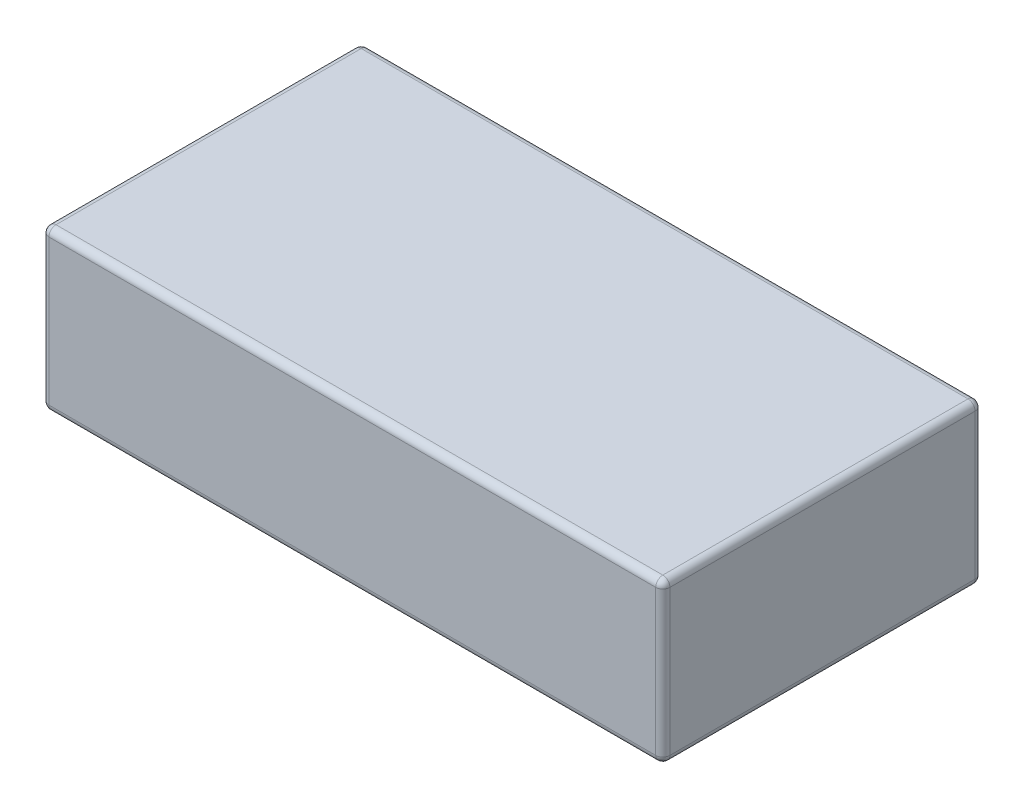
ISO-10303-21;
HEADER;
FILE_DESCRIPTION(('STEP AP214'),'2;1');
FILE_NAME('part.step','',(''),(''),'','','');
FILE_SCHEMA(('AUTOMOTIVE_DESIGN { 1 0 10303 214 1 1 1 1 }'));
ENDSEC;
DATA;
#1=APPLICATION_CONTEXT('core data for automotive mechanical design processes');
#2=APPLICATION_PROTOCOL_DEFINITION('international standard','automotive_design',2000,#1);
#3=PRODUCT_CONTEXT('',#1,'mechanical');
#4=PRODUCT('Part','Part','',(#3));
#5=PRODUCT_RELATED_PRODUCT_CATEGORY('part','',(#4));
#6=PRODUCT_DEFINITION_FORMATION('','',#4);
#7=PRODUCT_DEFINITION_CONTEXT('part definition',#1,'design');
#8=PRODUCT_DEFINITION('design','',#6,#7);
#9=PRODUCT_DEFINITION_SHAPE('','',#8);
#10=(LENGTH_UNIT() NAMED_UNIT(*) SI_UNIT(.MILLI.,.METRE.));
#11=(NAMED_UNIT(*) PLANE_ANGLE_UNIT() SI_UNIT($,.RADIAN.));
#12=(NAMED_UNIT(*) SI_UNIT($,.STERADIAN.) SOLID_ANGLE_UNIT());
#13=UNCERTAINTY_MEASURE_WITH_UNIT(LENGTH_MEASURE(1.E-05),#10,'distance_accuracy_value','');
#14=(GEOMETRIC_REPRESENTATION_CONTEXT(3) GLOBAL_UNCERTAINTY_ASSIGNED_CONTEXT((#13)) GLOBAL_UNIT_ASSIGNED_CONTEXT((#10,
#11,#12)) REPRESENTATION_CONTEXT('',''));
#15=CARTESIAN_POINT('',(0.,0.,0.));
#16=DIRECTION('',(0.,0.,1.));
#17=DIRECTION('',(1.,0.,0.));
#18=AXIS2_PLACEMENT_3D('',#15,#16,#17);
#19=CARTESIAN_POINT('',(87.5,22.5,90.));
#20=DIRECTION('',(-1.,0.,0.));
#21=DIRECTION('',(0.,0.,1.));
#22=AXIS2_PLACEMENT_3D('',#19,#20,#21);
#23=PLANE('',#22);
#24=DIRECTION('',(0.,1.,0.));
#25=VECTOR('',#24,1.);
#26=CARTESIAN_POINT('',(87.5,-22.5,88.));
#27=LINE('',#26,#25);
#28=CARTESIAN_POINT('',(87.5,20.5,88.));
#29=VERTEX_POINT('',#28);
#30=CARTESIAN_POINT('',(87.5,-20.5,88.));
#31=VERTEX_POINT('',#30);
#32=EDGE_CURVE('E48',#29,#31,#27,.F.);
#33=ORIENTED_EDGE('',*,*,#32,.T.);
#34=DIRECTION('',(0.,0.,-1.));
#35=VECTOR('',#34,1.);
#36=CARTESIAN_POINT('',(87.5,-20.5,90.));
#37=LINE('',#36,#35);
#38=CARTESIAN_POINT('',(87.5,-20.5,2.));
#39=VERTEX_POINT('',#38);
#40=EDGE_CURVE('E11',#31,#39,#37,.T.);
#41=ORIENTED_EDGE('',*,*,#40,.T.);
#42=DIRECTION('',(0.,1.,0.));
#43=VECTOR('',#42,1.);
#44=CARTESIAN_POINT('',(87.5,22.5,2.));
#45=LINE('',#44,#43);
#46=CARTESIAN_POINT('',(87.5,20.5,2.));
#47=VERTEX_POINT('',#46);
#48=EDGE_CURVE('E200',#39,#47,#45,.T.);
#49=ORIENTED_EDGE('',*,*,#48,.T.);
#50=DIRECTION('',(0.,0.,-1.));
#51=VECTOR('',#50,1.);
#52=CARTESIAN_POINT('',(87.5,20.5,90.));
#53=LINE('',#52,#51);
#54=EDGE_CURVE('E59',#47,#29,#53,.F.);
#55=ORIENTED_EDGE('',*,*,#54,.T.);
#56=EDGE_LOOP('',(#33,#41,#49,#55));
#57=FACE_BOUND('',#56,.T.);
#58=ADVANCED_FACE('F39',(#57),#23,.F.);
#59=CARTESIAN_POINT('',(-87.5,22.5,90.));
#60=DIRECTION('',(0.,-1.,0.));
#61=DIRECTION('',(0.,0.,-1.));
#62=AXIS2_PLACEMENT_3D('',#59,#60,#61);
#63=PLANE('',#62);
#64=DIRECTION('',(0.,0.,-1.));
#65=VECTOR('',#64,1.);
#66=CARTESIAN_POINT('',(-85.5,22.5,90.));
#67=LINE('',#66,#65);
#68=CARTESIAN_POINT('',(-85.5,22.5,2.));
#69=VERTEX_POINT('',#68);
#70=CARTESIAN_POINT('',(-85.5,22.5,88.));
#71=VERTEX_POINT('',#70);
#72=EDGE_CURVE('E195',#69,#71,#67,.F.);
#73=ORIENTED_EDGE('',*,*,#72,.T.);
#74=DIRECTION('',(-1.,0.,0.));
#75=VECTOR('',#74,1.);
#76=CARTESIAN_POINT('',(87.5,22.5,88.));
#77=LINE('',#76,#75);
#78=CARTESIAN_POINT('',(85.5,22.5,88.));
#79=VERTEX_POINT('',#78);
#80=EDGE_CURVE('E197',#71,#79,#77,.F.);
#81=ORIENTED_EDGE('',*,*,#80,.T.);
#82=DIRECTION('',(0.,0.,-1.));
#83=VECTOR('',#82,1.);
#84=CARTESIAN_POINT('',(85.5,22.5,90.));
#85=LINE('',#84,#83);
#86=CARTESIAN_POINT('',(85.5,22.5,2.));
#87=VERTEX_POINT('',#86);
#88=EDGE_CURVE('E191',#79,#87,#85,.T.);
#89=ORIENTED_EDGE('',*,*,#88,.T.);
#90=DIRECTION('',(-1.,0.,0.));
#91=VECTOR('',#90,1.);
#92=CARTESIAN_POINT('',(-87.5,22.5,2.));
#93=LINE('',#92,#91);
#94=EDGE_CURVE('E193',#87,#69,#93,.T.);
#95=ORIENTED_EDGE('',*,*,#94,.T.);
#96=EDGE_LOOP('',(#73,#81,#89,#95));
#97=FACE_BOUND('',#96,.T.);
#98=ADVANCED_FACE('F284',(#97),#63,.F.);
#99=CARTESIAN_POINT('',(-87.5,22.5,90.));
#100=DIRECTION('',(1.,0.,0.));
#101=DIRECTION('',(0.,0.,-1.));
#102=AXIS2_PLACEMENT_3D('',#99,#100,#101);
#103=PLANE('',#102);
#104=DIRECTION('',(0.,0.,-1.));
#105=VECTOR('',#104,1.);
#106=CARTESIAN_POINT('',(-87.5,-20.5,90.));
#107=LINE('',#106,#105);
#108=CARTESIAN_POINT('',(-87.5,-20.5,2.));
#109=VERTEX_POINT('',#108);
#110=CARTESIAN_POINT('',(-87.5,-20.5,88.));
#111=VERTEX_POINT('',#110);
#112=EDGE_CURVE('E186',#109,#111,#107,.F.);
#113=ORIENTED_EDGE('',*,*,#112,.T.);
#114=DIRECTION('',(0.,-1.,0.));
#115=VECTOR('',#114,1.);
#116=CARTESIAN_POINT('',(-87.5,22.5,88.));
#117=LINE('',#116,#115);
#118=CARTESIAN_POINT('',(-87.5,20.5,88.));
#119=VERTEX_POINT('',#118);
#120=EDGE_CURVE('E188',#111,#119,#117,.F.);
#121=ORIENTED_EDGE('',*,*,#120,.T.);
#122=DIRECTION('',(0.,0.,-1.));
#123=VECTOR('',#122,1.);
#124=CARTESIAN_POINT('',(-87.5,20.5,90.));
#125=LINE('',#124,#123);
#126=CARTESIAN_POINT('',(-87.5,20.5,2.));
#127=VERTEX_POINT('',#126);
#128=EDGE_CURVE('E182',#119,#127,#125,.T.);
#129=ORIENTED_EDGE('',*,*,#128,.T.);
#130=DIRECTION('',(0.,-1.,0.));
#131=VECTOR('',#130,1.);
#132=CARTESIAN_POINT('',(-87.5,22.5,2.));
#133=LINE('',#132,#131);
#134=EDGE_CURVE('E184',#127,#109,#133,.T.);
#135=ORIENTED_EDGE('',*,*,#134,.T.);
#136=EDGE_LOOP('',(#113,#121,#129,#135));
#137=FACE_BOUND('',#136,.T.);
#138=ADVANCED_FACE('F275',(#137),#103,.F.);
#139=CARTESIAN_POINT('',(-87.5,-22.5,90.));
#140=DIRECTION('',(0.,1.,0.));
#141=DIRECTION('',(0.,0.,1.));
#142=AXIS2_PLACEMENT_3D('',#139,#140,#141);
#143=PLANE('',#142);
#144=DIRECTION('',(1.,0.,0.));
#145=VECTOR('',#144,1.);
#146=CARTESIAN_POINT('',(-87.5,-22.5,88.));
#147=LINE('',#146,#145);
#148=CARTESIAN_POINT('',(85.5,-22.5,88.));
#149=VERTEX_POINT('',#148);
#150=CARTESIAN_POINT('',(-85.5,-22.5,88.));
#151=VERTEX_POINT('',#150);
#152=EDGE_CURVE('E135',#149,#151,#147,.F.);
#153=ORIENTED_EDGE('',*,*,#152,.T.);
#154=DIRECTION('',(0.,0.,-1.));
#155=VECTOR('',#154,1.);
#156=CARTESIAN_POINT('',(-85.5,-22.5,90.));
#157=LINE('',#156,#155);
#158=CARTESIAN_POINT('',(-85.5,-22.5,2.));
#159=VERTEX_POINT('',#158);
#160=EDGE_CURVE('E171',#151,#159,#157,.T.);
#161=ORIENTED_EDGE('',*,*,#160,.T.);
#162=DIRECTION('',(1.,0.,0.));
#163=VECTOR('',#162,1.);
#164=CARTESIAN_POINT('',(-87.5,-22.5,2.));
#165=LINE('',#164,#163);
#166=CARTESIAN_POINT('',(85.5,-22.5,2.));
#167=VERTEX_POINT('',#166);
#168=EDGE_CURVE('E164',#159,#167,#165,.T.);
#169=ORIENTED_EDGE('',*,*,#168,.T.);
#170=DIRECTION('',(0.,0.,-1.));
#171=VECTOR('',#170,1.);
#172=CARTESIAN_POINT('',(85.5,-22.5,90.));
#173=LINE('',#172,#171);
#174=EDGE_CURVE('E162',#167,#149,#173,.F.);
#175=ORIENTED_EDGE('',*,*,#174,.T.);
#176=EDGE_LOOP('',(#153,#161,#169,#175));
#177=FACE_BOUND('',#176,.T.);
#178=ADVANCED_FACE('F362',(#177),#143,.F.);
#179=CARTESIAN_POINT('',(0.,0.,90.));
#180=DIRECTION('',(0.,0.,1.));
#181=DIRECTION('',(1.,0.,0.));
#182=AXIS2_PLACEMENT_3D('',#179,#180,#181);
#183=PLANE('',#182);
#184=DIRECTION('',(0.,-1.,0.));
#185=VECTOR('',#184,1.);
#186=CARTESIAN_POINT('',(-85.5,-22.5,90.));
#187=LINE('',#186,#185);
#188=CARTESIAN_POINT('',(-85.5,20.5,90.));
#189=VERTEX_POINT('',#188);
#190=CARTESIAN_POINT('',(-85.5,-20.5,90.));
#191=VERTEX_POINT('',#190);
#192=EDGE_CURVE('E160',#189,#191,#187,.T.);
#193=ORIENTED_EDGE('',*,*,#192,.T.);
#194=DIRECTION('',(1.,0.,0.));
#195=VECTOR('',#194,1.);
#196=CARTESIAN_POINT('',(87.5,-20.5,90.));
#197=LINE('',#196,#195);
#198=CARTESIAN_POINT('',(85.5,-20.5,90.));
#199=VERTEX_POINT('',#198);
#200=EDGE_CURVE('E133',#191,#199,#197,.T.);
#201=ORIENTED_EDGE('',*,*,#200,.T.);
#202=DIRECTION('',(0.,1.,0.));
#203=VECTOR('',#202,1.);
#204=CARTESIAN_POINT('',(85.5,22.5,90.));
#205=LINE('',#204,#203);
#206=CARTESIAN_POINT('',(85.5,20.5,90.));
#207=VERTEX_POINT('',#206);
#208=EDGE_CURVE('E150',#199,#207,#205,.T.);
#209=ORIENTED_EDGE('',*,*,#208,.T.);
#210=DIRECTION('',(-1.,0.,0.));
#211=VECTOR('',#210,1.);
#212=CARTESIAN_POINT('',(-87.5,20.5,90.));
#213=LINE('',#212,#211);
#214=EDGE_CURVE('E156',#207,#189,#213,.T.);
#215=ORIENTED_EDGE('',*,*,#214,.T.);
#216=EDGE_LOOP('',(#193,#201,#209,#215));
#217=FACE_BOUND('',#216,.T.);
#218=ADVANCED_FACE('F158',(#217),#183,.T.);
#219=CARTESIAN_POINT('',(0.,0.,0.));
#220=DIRECTION('',(0.,0.,1.));
#221=DIRECTION('',(1.,0.,0.));
#222=AXIS2_PLACEMENT_3D('',#219,#220,#221);
#223=PLANE('',#222);
#224=DIRECTION('',(0.,1.,0.));
#225=VECTOR('',#224,1.);
#226=CARTESIAN_POINT('',(85.5,0.,0.));
#227=LINE('',#226,#225);
#228=CARTESIAN_POINT('',(85.5,20.5,0.));
#229=VERTEX_POINT('',#228);
#230=CARTESIAN_POINT('',(85.5,-20.5,0.));
#231=VERTEX_POINT('',#230);
#232=EDGE_CURVE('E173',#229,#231,#227,.F.);
#233=ORIENTED_EDGE('',*,*,#232,.T.);
#234=DIRECTION('',(1.,0.,0.));
#235=VECTOR('',#234,1.);
#236=CARTESIAN_POINT('',(0.,-20.5,0.));
#237=LINE('',#236,#235);
#238=CARTESIAN_POINT('',(-85.5,-20.5,0.));
#239=VERTEX_POINT('',#238);
#240=EDGE_CURVE('E179',#231,#239,#237,.F.);
#241=ORIENTED_EDGE('',*,*,#240,.T.);
#242=DIRECTION('',(0.,-1.,0.));
#243=VECTOR('',#242,1.);
#244=CARTESIAN_POINT('',(-85.5,0.,0.));
#245=LINE('',#244,#243);
#246=CARTESIAN_POINT('',(-85.5,20.5,0.));
#247=VERTEX_POINT('',#246);
#248=EDGE_CURVE('E177',#239,#247,#245,.F.);
#249=ORIENTED_EDGE('',*,*,#248,.T.);
#250=DIRECTION('',(-1.,0.,0.));
#251=VECTOR('',#250,1.);
#252=CARTESIAN_POINT('',(0.,20.5,0.));
#253=LINE('',#252,#251);
#254=EDGE_CURVE('E175',#247,#229,#253,.F.);
#255=ORIENTED_EDGE('',*,*,#254,.T.);
#256=EDGE_LOOP('',(#233,#241,#249,#255));
#257=FACE_BOUND('',#256,.T.);
#258=ADVANCED_FACE('F302',(#257),#223,.F.);
#259=CARTESIAN_POINT('',(-87.5,20.5,2.));
#260=DIRECTION('',(-1.,0.,0.));
#261=DIRECTION('',(0.,0.,1.));
#262=AXIS2_PLACEMENT_3D('',#259,#260,#261);
#263=CYLINDRICAL_SURFACE('',#262,2.);
#264=CARTESIAN_POINT('',(-85.5,20.5,2.));
#265=DIRECTION('',(-1.,0.,0.));
#266=DIRECTION('',(0.,0.,1.));
#267=AXIS2_PLACEMENT_3D('',#264,#265,#266);
#268=CIRCLE('',#267,2.);
#269=EDGE_CURVE('E43',#69,#247,#268,.T.);
#270=ORIENTED_EDGE('',*,*,#269,.F.);
#271=ORIENTED_EDGE('',*,*,#94,.F.);
#272=CARTESIAN_POINT('',(85.5,20.5,2.));
#273=DIRECTION('',(1.,0.,0.));
#274=DIRECTION('',(0.,1.,0.));
#275=AXIS2_PLACEMENT_3D('',#272,#273,#274);
#276=CIRCLE('',#275,2.);
#277=EDGE_CURVE('E252',#229,#87,#276,.T.);
#278=ORIENTED_EDGE('',*,*,#277,.F.);
#279=ORIENTED_EDGE('',*,*,#254,.F.);
#280=EDGE_LOOP('',(#270,#271,#278,#279));
#281=FACE_BOUND('',#280,.T.);
#282=ADVANCED_FACE('F41',(#281),#263,.T.);
#283=CARTESIAN_POINT('',(-85.5,20.5,2.));
#284=DIRECTION('',(0.,0.,1.));
#285=DIRECTION('',(1.,0.,0.));
#286=AXIS2_PLACEMENT_3D('',#283,#284,#285);
#287=SPHERICAL_SURFACE('',#286,2.);
#288=CARTESIAN_POINT('',(-85.5,20.5,2.));
#289=DIRECTION('',(0.,0.,-1.));
#290=DIRECTION('',(-1.,0.,0.));
#291=AXIS2_PLACEMENT_3D('',#288,#289,#290);
#292=CIRCLE('',#291,2.);
#293=EDGE_CURVE('E247',#69,#127,#292,.F.);
#294=ORIENTED_EDGE('',*,*,#293,.F.);
#295=ORIENTED_EDGE('',*,*,#269,.T.);
#296=CARTESIAN_POINT('',(-85.5,20.5,2.));
#297=DIRECTION('',(0.,1.,0.));
#298=DIRECTION('',(0.,0.,1.));
#299=AXIS2_PLACEMENT_3D('',#296,#297,#298);
#300=CIRCLE('',#299,2.);
#301=EDGE_CURVE('E250',#127,#247,#300,.F.);
#302=ORIENTED_EDGE('',*,*,#301,.F.);
#303=EDGE_LOOP('',(#294,#295,#302));
#304=FACE_BOUND('',#303,.T.);
#305=ADVANCED_FACE('F263',(#304),#287,.T.);
#306=CARTESIAN_POINT('',(85.5,20.5,2.));
#307=DIRECTION('',(0.,0.,1.));
#308=DIRECTION('',(1.,0.,0.));
#309=AXIS2_PLACEMENT_3D('',#306,#307,#308);
#310=SPHERICAL_SURFACE('',#309,2.);
#311=CARTESIAN_POINT('',(85.5,20.5,2.));
#312=DIRECTION('',(0.,1.,0.));
#313=DIRECTION('',(0.,0.,1.));
#314=AXIS2_PLACEMENT_3D('',#311,#312,#313);
#315=CIRCLE('',#314,2.);
#316=EDGE_CURVE('E241',#229,#47,#315,.F.);
#317=ORIENTED_EDGE('',*,*,#316,.F.);
#318=ORIENTED_EDGE('',*,*,#277,.T.);
#319=CARTESIAN_POINT('',(85.5,20.5,2.));
#320=DIRECTION('',(0.,0.,-1.));
#321=DIRECTION('',(-1.,0.,0.));
#322=AXIS2_PLACEMENT_3D('',#319,#320,#321);
#323=CIRCLE('',#322,2.);
#324=EDGE_CURVE('E244',#47,#87,#323,.F.);
#325=ORIENTED_EDGE('',*,*,#324,.F.);
#326=EDGE_LOOP('',(#317,#318,#325));
#327=FACE_BOUND('',#326,.T.);
#328=ADVANCED_FACE('F295',(#327),#310,.T.);
#329=CARTESIAN_POINT('',(-85.5,22.5,2.));
#330=DIRECTION('',(0.,-1.,0.));
#331=DIRECTION('',(0.,0.,-1.));
#332=AXIS2_PLACEMENT_3D('',#329,#330,#331);
#333=CYLINDRICAL_SURFACE('',#332,2.);
#334=ORIENTED_EDGE('',*,*,#301,.T.);
#335=ORIENTED_EDGE('',*,*,#248,.F.);
#336=CARTESIAN_POINT('',(-85.5,-20.5,2.));
#337=DIRECTION('',(0.,-1.,0.));
#338=DIRECTION('',(0.,0.,-1.));
#339=AXIS2_PLACEMENT_3D('',#336,#337,#338);
#340=CIRCLE('',#339,2.);
#341=EDGE_CURVE('E236',#109,#239,#340,.T.);
#342=ORIENTED_EDGE('',*,*,#341,.F.);
#343=ORIENTED_EDGE('',*,*,#134,.F.);
#344=EDGE_LOOP('',(#334,#335,#342,#343));
#345=FACE_BOUND('',#344,.T.);
#346=ADVANCED_FACE('F271',(#345),#333,.T.);
#347=CARTESIAN_POINT('',(-85.5,20.5,90.));
#348=DIRECTION('',(0.,0.,-1.));
#349=DIRECTION('',(-1.,0.,0.));
#350=AXIS2_PLACEMENT_3D('',#347,#348,#349);
#351=CYLINDRICAL_SURFACE('',#350,2.);
#352=ORIENTED_EDGE('',*,*,#293,.T.);
#353=ORIENTED_EDGE('',*,*,#128,.F.);
#354=CARTESIAN_POINT('',(-85.5,20.5,88.));
#355=DIRECTION('',(0.,0.,1.));
#356=DIRECTION('',(1.,0.,0.));
#357=AXIS2_PLACEMENT_3D('',#354,#355,#356);
#358=CIRCLE('',#357,2.);
#359=EDGE_CURVE('E233',#71,#119,#358,.T.);
#360=ORIENTED_EDGE('',*,*,#359,.F.);
#361=ORIENTED_EDGE('',*,*,#72,.F.);
#362=EDGE_LOOP('',(#352,#353,#360,#361));
#363=FACE_BOUND('',#362,.T.);
#364=ADVANCED_FACE('F281',(#363),#351,.T.);
#365=CARTESIAN_POINT('',(0.,20.5,88.));
#366=DIRECTION('',(1.,0.,0.));
#367=DIRECTION('',(0.,0.,-1.));
#368=AXIS2_PLACEMENT_3D('',#365,#366,#367);
#369=CYLINDRICAL_SURFACE('',#368,2.);
#370=CARTESIAN_POINT('',(85.5,20.5,88.));
#371=DIRECTION('',(1.,0.,0.));
#372=DIRECTION('',(0.,0.,-1.));
#373=AXIS2_PLACEMENT_3D('',#370,#371,#372);
#374=CIRCLE('',#373,2.);
#375=EDGE_CURVE('E227',#79,#207,#374,.T.);
#376=ORIENTED_EDGE('',*,*,#375,.F.);
#377=ORIENTED_EDGE('',*,*,#80,.F.);
#378=CARTESIAN_POINT('',(-85.5,20.5,88.));
#379=DIRECTION('',(-1.,0.,0.));
#380=DIRECTION('',(0.,0.,1.));
#381=AXIS2_PLACEMENT_3D('',#378,#379,#380);
#382=CIRCLE('',#381,2.);
#383=EDGE_CURVE('E230',#189,#71,#382,.T.);
#384=ORIENTED_EDGE('',*,*,#383,.F.);
#385=ORIENTED_EDGE('',*,*,#214,.F.);
#386=EDGE_LOOP('',(#376,#377,#384,#385));
#387=FACE_BOUND('',#386,.T.);
#388=ADVANCED_FACE('F288',(#387),#369,.T.);
#389=CARTESIAN_POINT('',(85.5,20.5,90.));
#390=DIRECTION('',(0.,0.,-1.));
#391=DIRECTION('',(-1.,0.,0.));
#392=AXIS2_PLACEMENT_3D('',#389,#390,#391);
#393=CYLINDRICAL_SURFACE('',#392,2.);
#394=ORIENTED_EDGE('',*,*,#324,.T.);
#395=ORIENTED_EDGE('',*,*,#88,.F.);
#396=CARTESIAN_POINT('',(85.5,20.5,88.));
#397=DIRECTION('',(0.,0.,1.));
#398=DIRECTION('',(1.,0.,0.));
#399=AXIS2_PLACEMENT_3D('',#396,#397,#398);
#400=CIRCLE('',#399,2.);
#401=EDGE_CURVE('E225',#29,#79,#400,.T.);
#402=ORIENTED_EDGE('',*,*,#401,.F.);
#403=ORIENTED_EDGE('',*,*,#54,.F.);
#404=EDGE_LOOP('',(#394,#395,#402,#403));
#405=FACE_BOUND('',#404,.T.);
#406=ADVANCED_FACE('F293',(#405),#393,.T.);
#407=CARTESIAN_POINT('',(85.5,22.5,2.));
#408=DIRECTION('',(0.,1.,0.));
#409=DIRECTION('',(0.,0.,1.));
#410=AXIS2_PLACEMENT_3D('',#407,#408,#409);
#411=CYLINDRICAL_SURFACE('',#410,2.);
#412=ORIENTED_EDGE('',*,*,#316,.T.);
#413=ORIENTED_EDGE('',*,*,#48,.F.);
#414=CARTESIAN_POINT('',(85.5,-20.5,2.));
#415=DIRECTION('',(0.,-1.,0.));
#416=DIRECTION('',(1.,0.,0.));
#417=AXIS2_PLACEMENT_3D('',#414,#415,#416);
#418=CIRCLE('',#417,2.);
#419=EDGE_CURVE('E222',#231,#39,#418,.T.);
#420=ORIENTED_EDGE('',*,*,#419,.F.);
#421=ORIENTED_EDGE('',*,*,#232,.F.);
#422=EDGE_LOOP('',(#412,#413,#420,#421));
#423=FACE_BOUND('',#422,.T.);
#424=ADVANCED_FACE('F299',(#423),#411,.T.);
#425=CARTESIAN_POINT('',(-87.5,-20.5,2.));
#426=DIRECTION('',(1.,0.,0.));
#427=DIRECTION('',(0.,0.,-1.));
#428=AXIS2_PLACEMENT_3D('',#425,#426,#427);
#429=CYLINDRICAL_SURFACE('',#428,2.);
#430=CARTESIAN_POINT('',(-85.5,-20.5,2.));
#431=DIRECTION('',(-1.,0.,0.));
#432=DIRECTION('',(0.,0.,1.));
#433=AXIS2_PLACEMENT_3D('',#430,#431,#432);
#434=CIRCLE('',#433,2.);
#435=EDGE_CURVE('E238',#239,#159,#434,.T.);
#436=ORIENTED_EDGE('',*,*,#435,.F.);
#437=ORIENTED_EDGE('',*,*,#240,.F.);
#438=CARTESIAN_POINT('',(85.5,-20.5,2.));
#439=DIRECTION('',(1.,0.,0.));
#440=DIRECTION('',(0.,0.,-1.));
#441=AXIS2_PLACEMENT_3D('',#438,#439,#440);
#442=CIRCLE('',#441,2.);
#443=EDGE_CURVE('E219',#167,#231,#442,.T.);
#444=ORIENTED_EDGE('',*,*,#443,.F.);
#445=ORIENTED_EDGE('',*,*,#168,.F.);
#446=EDGE_LOOP('',(#436,#437,#444,#445));
#447=FACE_BOUND('',#446,.T.);
#448=ADVANCED_FACE('F306',(#447),#429,.T.);
#449=CARTESIAN_POINT('',(-85.5,-20.5,2.));
#450=DIRECTION('',(0.,0.,1.));
#451=DIRECTION('',(1.,0.,0.));
#452=AXIS2_PLACEMENT_3D('',#449,#450,#451);
#453=SPHERICAL_SURFACE('',#452,2.);
#454=ORIENTED_EDGE('',*,*,#341,.T.);
#455=ORIENTED_EDGE('',*,*,#435,.T.);
#456=CARTESIAN_POINT('',(-85.5,-20.5,2.));
#457=DIRECTION('',(0.,0.,-1.));
#458=DIRECTION('',(-1.,0.,0.));
#459=AXIS2_PLACEMENT_3D('',#456,#457,#458);
#460=CIRCLE('',#459,2.);
#461=EDGE_CURVE('E216',#109,#159,#460,.F.);
#462=ORIENTED_EDGE('',*,*,#461,.F.);
#463=EDGE_LOOP('',(#454,#455,#462));
#464=FACE_BOUND('',#463,.T.);
#465=ADVANCED_FACE('F310',(#464),#453,.T.);
#466=CARTESIAN_POINT('',(-85.5,20.5,88.));
#467=DIRECTION('',(0.,0.,1.));
#468=DIRECTION('',(1.,0.,0.));
#469=AXIS2_PLACEMENT_3D('',#466,#467,#468);
#470=SPHERICAL_SURFACE('',#469,2.);
#471=ORIENTED_EDGE('',*,*,#383,.T.);
#472=ORIENTED_EDGE('',*,*,#359,.T.);
#473=CARTESIAN_POINT('',(-85.5,20.5,88.));
#474=DIRECTION('',(0.,1.,0.));
#475=DIRECTION('',(0.,0.,1.));
#476=AXIS2_PLACEMENT_3D('',#473,#474,#475);
#477=CIRCLE('',#476,2.);
#478=EDGE_CURVE('E214',#189,#119,#477,.F.);
#479=ORIENTED_EDGE('',*,*,#478,.F.);
#480=EDGE_LOOP('',(#471,#472,#479));
#481=FACE_BOUND('',#480,.T.);
#482=ADVANCED_FACE('F321',(#481),#470,.T.);
#483=CARTESIAN_POINT('',(85.5,20.5,88.));
#484=DIRECTION('',(0.,0.,1.));
#485=DIRECTION('',(1.,0.,0.));
#486=AXIS2_PLACEMENT_3D('',#483,#484,#485);
#487=SPHERICAL_SURFACE('',#486,2.);
#488=ORIENTED_EDGE('',*,*,#401,.T.);
#489=ORIENTED_EDGE('',*,*,#375,.T.);
#490=CARTESIAN_POINT('',(85.5,20.5,88.));
#491=DIRECTION('',(0.,1.,0.));
#492=DIRECTION('',(0.,0.,1.));
#493=AXIS2_PLACEMENT_3D('',#490,#491,#492);
#494=CIRCLE('',#493,2.);
#495=EDGE_CURVE('E153',#29,#207,#494,.F.);
#496=ORIENTED_EDGE('',*,*,#495,.F.);
#497=EDGE_LOOP('',(#488,#489,#496));
#498=FACE_BOUND('',#497,.T.);
#499=ADVANCED_FACE('F323',(#498),#487,.T.);
#500=CARTESIAN_POINT('',(85.5,-20.5,2.));
#501=DIRECTION('',(0.,0.,1.));
#502=DIRECTION('',(1.,0.,0.));
#503=AXIS2_PLACEMENT_3D('',#500,#501,#502);
#504=SPHERICAL_SURFACE('',#503,2.);
#505=ORIENTED_EDGE('',*,*,#443,.T.);
#506=ORIENTED_EDGE('',*,*,#419,.T.);
#507=CARTESIAN_POINT('',(85.5,-20.5,2.));
#508=DIRECTION('',(0.,0.,-1.));
#509=DIRECTION('',(-1.,0.,0.));
#510=AXIS2_PLACEMENT_3D('',#507,#508,#509);
#511=CIRCLE('',#510,2.);
#512=EDGE_CURVE('E211',#167,#39,#511,.F.);
#513=ORIENTED_EDGE('',*,*,#512,.F.);
#514=EDGE_LOOP('',(#505,#506,#513));
#515=FACE_BOUND('',#514,.T.);
#516=ADVANCED_FACE('F329',(#515),#504,.T.);
#517=CARTESIAN_POINT('',(-85.5,-20.5,90.));
#518=DIRECTION('',(0.,0.,-1.));
#519=DIRECTION('',(-1.,0.,0.));
#520=AXIS2_PLACEMENT_3D('',#517,#518,#519);
#521=CYLINDRICAL_SURFACE('',#520,2.);
#522=ORIENTED_EDGE('',*,*,#461,.T.);
#523=ORIENTED_EDGE('',*,*,#160,.F.);
#524=CARTESIAN_POINT('',(-85.5,-20.5,88.));
#525=DIRECTION('',(0.,0.,1.));
#526=DIRECTION('',(1.,0.,0.));
#527=AXIS2_PLACEMENT_3D('',#524,#525,#526);
#528=CIRCLE('',#527,2.);
#529=EDGE_CURVE('E208',#111,#151,#528,.T.);
#530=ORIENTED_EDGE('',*,*,#529,.F.);
#531=ORIENTED_EDGE('',*,*,#112,.F.);
#532=EDGE_LOOP('',(#522,#523,#530,#531));
#533=FACE_BOUND('',#532,.T.);
#534=ADVANCED_FACE('F313',(#533),#521,.T.);
#535=CARTESIAN_POINT('',(-85.5,0.,88.));
#536=DIRECTION('',(0.,1.,0.));
#537=DIRECTION('',(0.,0.,1.));
#538=AXIS2_PLACEMENT_3D('',#535,#536,#537);
#539=CYLINDRICAL_SURFACE('',#538,2.);
#540=ORIENTED_EDGE('',*,*,#478,.T.);
#541=ORIENTED_EDGE('',*,*,#120,.F.);
#542=CARTESIAN_POINT('',(-85.5,-20.5,88.));
#543=DIRECTION('',(0.,-1.,0.));
#544=DIRECTION('',(0.,0.,-1.));
#545=AXIS2_PLACEMENT_3D('',#542,#543,#544);
#546=CIRCLE('',#545,2.);
#547=EDGE_CURVE('E147',#191,#111,#546,.T.);
#548=ORIENTED_EDGE('',*,*,#547,.F.);
#549=ORIENTED_EDGE('',*,*,#192,.F.);
#550=EDGE_LOOP('',(#540,#541,#548,#549));
#551=FACE_BOUND('',#550,.T.);
#552=ADVANCED_FACE('F319',(#551),#539,.T.);
#553=CARTESIAN_POINT('',(85.5,0.,88.));
#554=DIRECTION('',(0.,-1.,0.));
#555=DIRECTION('',(0.,0.,-1.));
#556=AXIS2_PLACEMENT_3D('',#553,#554,#555);
#557=CYLINDRICAL_SURFACE('',#556,2.);
#558=ORIENTED_EDGE('',*,*,#495,.T.);
#559=ORIENTED_EDGE('',*,*,#208,.F.);
#560=CARTESIAN_POINT('',(85.5,-20.5,88.));
#561=DIRECTION('',(0.,-1.,0.));
#562=DIRECTION('',(0.,0.,-1.));
#563=AXIS2_PLACEMENT_3D('',#560,#561,#562);
#564=CIRCLE('',#563,2.);
#565=EDGE_CURVE('E141',#31,#199,#564,.T.);
#566=ORIENTED_EDGE('',*,*,#565,.F.);
#567=ORIENTED_EDGE('',*,*,#32,.F.);
#568=EDGE_LOOP('',(#558,#559,#566,#567));
#569=FACE_BOUND('',#568,.T.);
#570=ADVANCED_FACE('F151',(#569),#557,.T.);
#571=CARTESIAN_POINT('',(85.5,-20.5,90.));
#572=DIRECTION('',(0.,0.,-1.));
#573=DIRECTION('',(-1.,0.,0.));
#574=AXIS2_PLACEMENT_3D('',#571,#572,#573);
#575=CYLINDRICAL_SURFACE('',#574,2.);
#576=ORIENTED_EDGE('',*,*,#512,.T.);
#577=ORIENTED_EDGE('',*,*,#40,.F.);
#578=CARTESIAN_POINT('',(85.5,-20.5,88.));
#579=DIRECTION('',(0.,0.,1.));
#580=DIRECTION('',(1.,0.,0.));
#581=AXIS2_PLACEMENT_3D('',#578,#579,#580);
#582=CIRCLE('',#581,2.);
#583=EDGE_CURVE('E145',#149,#31,#582,.T.);
#584=ORIENTED_EDGE('',*,*,#583,.F.);
#585=ORIENTED_EDGE('',*,*,#174,.F.);
#586=EDGE_LOOP('',(#576,#577,#584,#585));
#587=FACE_BOUND('',#586,.T.);
#588=ADVANCED_FACE('F346',(#587),#575,.T.);
#589=CARTESIAN_POINT('',(-85.5,-20.5,88.));
#590=DIRECTION('',(0.,0.,1.));
#591=DIRECTION('',(1.,0.,0.));
#592=AXIS2_PLACEMENT_3D('',#589,#590,#591);
#593=SPHERICAL_SURFACE('',#592,2.);
#594=ORIENTED_EDGE('',*,*,#547,.T.);
#595=ORIENTED_EDGE('',*,*,#529,.T.);
#596=CARTESIAN_POINT('',(-85.5,-20.5,88.));
#597=DIRECTION('',(-1.,0.,0.));
#598=DIRECTION('',(0.,0.,1.));
#599=AXIS2_PLACEMENT_3D('',#596,#597,#598);
#600=CIRCLE('',#599,2.);
#601=EDGE_CURVE('E138',#191,#151,#600,.F.);
#602=ORIENTED_EDGE('',*,*,#601,.F.);
#603=EDGE_LOOP('',(#594,#595,#602));
#604=FACE_BOUND('',#603,.T.);
#605=ADVANCED_FACE('F317',(#604),#593,.T.);
#606=CARTESIAN_POINT('',(85.5,-20.5,88.));
#607=DIRECTION('',(0.,0.,1.));
#608=DIRECTION('',(1.,0.,0.));
#609=AXIS2_PLACEMENT_3D('',#606,#607,#608);
#610=SPHERICAL_SURFACE('',#609,2.);
#611=ORIENTED_EDGE('',*,*,#583,.T.);
#612=ORIENTED_EDGE('',*,*,#565,.T.);
#613=CARTESIAN_POINT('',(85.5,-20.5,88.));
#614=DIRECTION('',(1.,0.,0.));
#615=DIRECTION('',(0.,0.,-1.));
#616=AXIS2_PLACEMENT_3D('',#613,#614,#615);
#617=CIRCLE('',#616,2.);
#618=EDGE_CURVE('E129',#149,#199,#617,.F.);
#619=ORIENTED_EDGE('',*,*,#618,.F.);
#620=EDGE_LOOP('',(#611,#612,#619));
#621=FACE_BOUND('',#620,.T.);
#622=ADVANCED_FACE('F143',(#621),#610,.T.);
#623=CARTESIAN_POINT('',(0.,-20.5,88.));
#624=DIRECTION('',(-1.,0.,0.));
#625=DIRECTION('',(0.,0.,1.));
#626=AXIS2_PLACEMENT_3D('',#623,#624,#625);
#627=CYLINDRICAL_SURFACE('',#626,2.);
#628=ORIENTED_EDGE('',*,*,#601,.T.);
#629=ORIENTED_EDGE('',*,*,#152,.F.);
#630=ORIENTED_EDGE('',*,*,#618,.T.);
#631=ORIENTED_EDGE('',*,*,#200,.F.);
#632=EDGE_LOOP('',(#628,#629,#630,#631));
#633=FACE_BOUND('',#632,.T.);
#634=ADVANCED_FACE('F131',(#633),#627,.T.);
#635=CLOSED_SHELL('',(#58,#98,#138,#178,#218,#258,#282,#305,#328,#346,#364,#388,#406,#424,#448,
#465,#482,#499,#516,#534,#552,#570,#588,#605,#622,#634));
#636=MANIFOLD_SOLID_BREP('B2',#635);
#637=ADVANCED_BREP_SHAPE_REPRESENTATION('',(#18,#636),#14);
#638=SHAPE_DEFINITION_REPRESENTATION(#9,#637);
ENDSEC;
END-ISO-10303-21;
